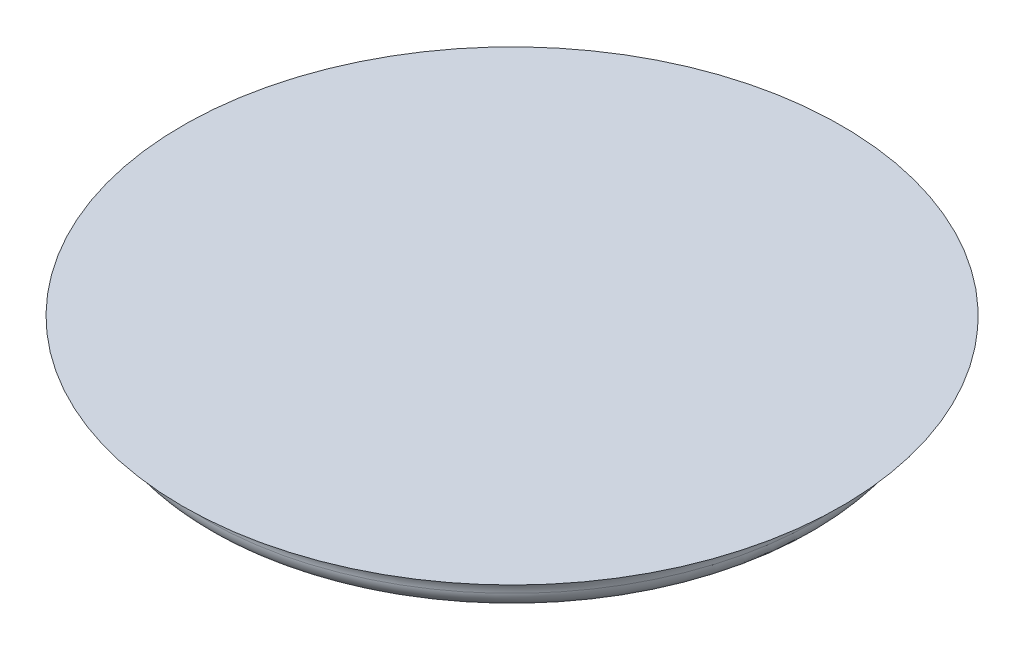
ISO-10303-21;
HEADER;
FILE_DESCRIPTION(('STEP AP214'),'2;1');
FILE_NAME('part.step','',(''),(''),'','','');
FILE_SCHEMA(('AUTOMOTIVE_DESIGN { 1 0 10303 214 1 1 1 1 }'));
ENDSEC;
DATA;
#1=APPLICATION_CONTEXT('core data for automotive mechanical design processes');
#2=APPLICATION_PROTOCOL_DEFINITION('international standard','automotive_design',2000,#1);
#3=PRODUCT_CONTEXT('',#1,'mechanical');
#4=PRODUCT('Part','Part','',(#3));
#5=PRODUCT_RELATED_PRODUCT_CATEGORY('part','',(#4));
#6=PRODUCT_DEFINITION_FORMATION('','',#4);
#7=PRODUCT_DEFINITION_CONTEXT('part definition',#1,'design');
#8=PRODUCT_DEFINITION('design','',#6,#7);
#9=PRODUCT_DEFINITION_SHAPE('','',#8);
#10=(LENGTH_UNIT() NAMED_UNIT(*) SI_UNIT(.MILLI.,.METRE.));
#11=(NAMED_UNIT(*) PLANE_ANGLE_UNIT() SI_UNIT($,.RADIAN.));
#12=(NAMED_UNIT(*) SI_UNIT($,.STERADIAN.) SOLID_ANGLE_UNIT());
#13=UNCERTAINTY_MEASURE_WITH_UNIT(LENGTH_MEASURE(1.E-05),#10,'distance_accuracy_value','');
#14=(GEOMETRIC_REPRESENTATION_CONTEXT(3) GLOBAL_UNCERTAINTY_ASSIGNED_CONTEXT((#13)) GLOBAL_UNIT_ASSIGNED_CONTEXT((#10,
#11,#12)) REPRESENTATION_CONTEXT('',''));
#15=CARTESIAN_POINT('',(0.,0.,0.));
#16=DIRECTION('',(0.,0.,1.));
#17=DIRECTION('',(1.,0.,0.));
#18=AXIS2_PLACEMENT_3D('',#15,#16,#17);
#19=CARTESIAN_POINT('',(0.,-5.,0.));
#20=DIRECTION('',(0.,-1.,0.));
#21=DIRECTION('',(0.,0.,-1.));
#22=AXIS2_PLACEMENT_3D('',#19,#20,#21);
#23=PLANE('',#22);
#24=CARTESIAN_POINT('',(0.,-5.,0.));
#25=DIRECTION('',(0.,-1.,0.));
#26=DIRECTION('',(0.,0.,-1.));
#27=AXIS2_PLACEMENT_3D('',#24,#25,#26);
#28=CIRCLE('',#27,35.);
#29=CARTESIAN_POINT('',(0.,-5.,-35.));
#30=VERTEX_POINT('',#29);
#31=EDGE_CURVE('E46',#30,#30,#28,.T.);
#32=ORIENTED_EDGE('',*,*,#31,.T.);
#33=EDGE_LOOP('',(#32));
#34=FACE_BOUND('',#33,.T.);
#35=ADVANCED_FACE('F39',(#34),#23,.T.);
#36=CARTESIAN_POINT('',(0.,-3.,0.));
#37=DIRECTION('',(0.,-1.,0.));
#38=DIRECTION('',(0.,0.,-1.));
#39=AXIS2_PLACEMENT_3D('',#36,#37,#38);
#40=TOROIDAL_SURFACE('',#39,35.,2.);
#41=CARTESIAN_POINT('',(0.,-3.,0.));
#42=DIRECTION('',(0.,-1.,0.));
#43=DIRECTION('',(0.,0.,-1.));
#44=AXIS2_PLACEMENT_3D('',#41,#42,#43);
#45=CIRCLE('',#44,37.);
#46=CARTESIAN_POINT('',(0.,-3.,-37.));
#47=VERTEX_POINT('',#46);
#48=EDGE_CURVE('E11',#47,#47,#45,.F.);
#49=ORIENTED_EDGE('',*,*,#48,.F.);
#50=EDGE_LOOP('',(#49));
#51=FACE_BOUND('',#50,.T.);
#52=ORIENTED_EDGE('',*,*,#31,.F.);
#53=EDGE_LOOP('',(#52));
#54=FACE_BOUND('',#53,.T.);
#55=ADVANCED_FACE('F64',(#51,#54),#40,.T.);
#56=CARTESIAN_POINT('',(0.,-3.,0.));
#57=DIRECTION('',(0.,1.,0.));
#58=DIRECTION('',(0.,0.,1.));
#59=AXIS2_PLACEMENT_3D('',#56,#57,#58);
#60=TOROIDAL_SURFACE('',#59,40.,3.);
#61=CARTESIAN_POINT('',(0.,0.,0.));
#62=DIRECTION('',(0.,1.,0.));
#63=DIRECTION('',(0.,0.,1.));
#64=AXIS2_PLACEMENT_3D('',#61,#62,#63);
#65=CIRCLE('',#64,40.);
#66=CARTESIAN_POINT('',(0.,0.,40.));
#67=VERTEX_POINT('',#66);
#68=EDGE_CURVE('E50',#67,#67,#65,.F.);
#69=ORIENTED_EDGE('',*,*,#68,.T.);
#70=EDGE_LOOP('',(#69));
#71=FACE_BOUND('',#70,.T.);
#72=ORIENTED_EDGE('',*,*,#48,.T.);
#73=EDGE_LOOP('',(#72));
#74=FACE_BOUND('',#73,.T.);
#75=ADVANCED_FACE('F41',(#71,#74),#60,.F.);
#76=CARTESIAN_POINT('',(100.,0.,-60.));
#77=DIRECTION('',(0.,-1.,0.));
#78=DIRECTION('',(0.,0.,-1.));
#79=AXIS2_PLACEMENT_3D('',#76,#77,#78);
#80=PLANE('',#79);
#81=ORIENTED_EDGE('',*,*,#68,.F.);
#82=EDGE_LOOP('',(#81));
#83=FACE_BOUND('',#82,.T.);
#84=ADVANCED_FACE('F58',(#83),#80,.F.);
#85=CLOSED_SHELL('',(#35,#55,#75,#84));
#86=MANIFOLD_SOLID_BREP('B2',#85);
#87=ADVANCED_BREP_SHAPE_REPRESENTATION('',(#18,#86),#14);
#88=SHAPE_DEFINITION_REPRESENTATION(#9,#87);
ENDSEC;
END-ISO-10303-21;
